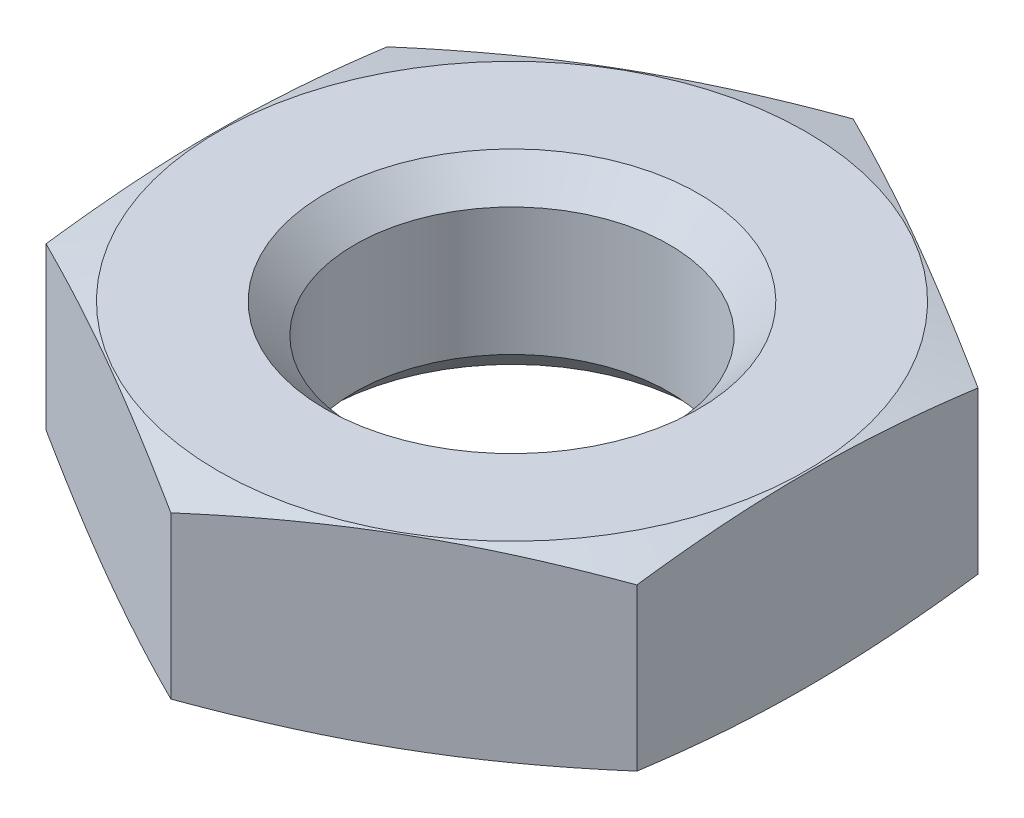
ISO-10303-21;
HEADER;
FILE_DESCRIPTION(('STEP AP214'),'2;1');
FILE_NAME('part.step','',(''),(''),'','','');
FILE_SCHEMA(('AUTOMOTIVE_DESIGN { 1 0 10303 214 1 1 1 1 }'));
ENDSEC;
DATA;
#1=APPLICATION_CONTEXT('core data for automotive mechanical design processes');
#2=APPLICATION_PROTOCOL_DEFINITION('international standard','automotive_design',2000,#1);
#3=PRODUCT_CONTEXT('',#1,'mechanical');
#4=PRODUCT('Part','Part','',(#3));
#5=PRODUCT_RELATED_PRODUCT_CATEGORY('part','',(#4));
#6=PRODUCT_DEFINITION_FORMATION('','',#4);
#7=PRODUCT_DEFINITION_CONTEXT('part definition',#1,'design');
#8=PRODUCT_DEFINITION('design','',#6,#7);
#9=PRODUCT_DEFINITION_SHAPE('','',#8);
#10=(LENGTH_UNIT() NAMED_UNIT(*) SI_UNIT(.MILLI.,.METRE.));
#11=(NAMED_UNIT(*) PLANE_ANGLE_UNIT() SI_UNIT($,.RADIAN.));
#12=(NAMED_UNIT(*) SI_UNIT($,.STERADIAN.) SOLID_ANGLE_UNIT());
#13=UNCERTAINTY_MEASURE_WITH_UNIT(LENGTH_MEASURE(1.E-05),#10,'distance_accuracy_value','');
#14=(GEOMETRIC_REPRESENTATION_CONTEXT(3) GLOBAL_UNCERTAINTY_ASSIGNED_CONTEXT((#13)) GLOBAL_UNIT_ASSIGNED_CONTEXT((#10,
#11,#12)) REPRESENTATION_CONTEXT('',''));
#15=CARTESIAN_POINT('',(0.,0.,0.));
#16=DIRECTION('',(0.,0.,1.));
#17=DIRECTION('',(1.,0.,0.));
#18=AXIS2_PLACEMENT_3D('',#15,#16,#17);
#19=CARTESIAN_POINT('',(0.,0.,0.));
#20=DIRECTION('',(0.,1.,0.));
#21=DIRECTION('',(0.,0.,1.));
#22=AXIS2_PLACEMENT_3D('',#19,#20,#21);
#23=PLANE('',#22);
#24=CARTESIAN_POINT('',(0.,0.,0.));
#25=DIRECTION('',(0.,1.,0.));
#26=DIRECTION('',(0.,0.,1.));
#27=AXIS2_PLACEMENT_3D('',#24,#25,#26);
#28=CIRCLE('',#27,6.);
#29=CARTESIAN_POINT('',(0.,0.,6.));
#30=VERTEX_POINT('',#29);
#31=EDGE_CURVE('E104',#30,#30,#28,.T.);
#32=ORIENTED_EDGE('',*,*,#31,.F.);
#33=EDGE_LOOP('',(#32));
#34=FACE_BOUND('',#33,.T.);
#35=CARTESIAN_POINT('',(0.,0.,0.));
#36=DIRECTION('',(0.,-1.,0.));
#37=DIRECTION('',(0.,0.,-1.));
#38=AXIS2_PLACEMENT_3D('',#35,#36,#37);
#39=CIRCLE('',#38,9.45);
#40=CARTESIAN_POINT('',(0.,0.,-9.45));
#41=VERTEX_POINT('',#40);
#42=EDGE_CURVE('E95',#41,#41,#39,.T.);
#43=ORIENTED_EDGE('',*,*,#42,.F.);
#44=EDGE_LOOP('',(#43));
#45=FACE_BOUND('',#44,.T.);
#46=ADVANCED_FACE('F35',(#34,#45),#23,.T.);
#47=CARTESIAN_POINT('',(0.,-3.,0.));
#48=DIRECTION('',(0.,-1.,0.));
#49=DIRECTION('',(0.,0.,-1.));
#50=AXIS2_PLACEMENT_3D('',#47,#48,#49);
#51=CONICAL_SURFACE('',#50,20.6461524227066,1.30899693899575);
#52=CARTESIAN_POINT('',(-9.5,-2.65271852718034,16.8575089634561));
#53=CARTESIAN_POINT('',(-9.5,-2.55792623123244,16.4513749844724));
#54=CARTESIAN_POINT('',(-9.5,-2.46389301942564,16.0450620927087));
#55=CARTESIAN_POINT('',(-9.5,-2.27769044820152,15.2320030409939));
#56=CARTESIAN_POINT('',(-9.5,-2.18552111797698,14.8252568743616));
#57=CARTESIAN_POINT('',(-9.5,-2.00337856324963,14.011195153163));
#58=CARTESIAN_POINT('',(-9.5,-1.91340573772246,13.6038795091545));
#59=CARTESIAN_POINT('',(-9.5,-1.73612888302161,12.7886681296335));
#60=CARTESIAN_POINT('',(-9.5,-1.64882484544963,12.3807723959506));
#61=CARTESIAN_POINT('',(-9.5,-1.47661188192415,11.5603167165323));
#62=CARTESIAN_POINT('',(-9.5,-1.39173464650062,11.1477501015404));
#63=CARTESIAN_POINT('',(-9.5,-1.226003346001,10.3218101778919));
#64=CARTESIAN_POINT('',(-9.5,-1.14514925000314,9.90843687546084));
#65=CARTESIAN_POINT('',(-9.5,-0.988363980886279,9.08070337328055));
#66=CARTESIAN_POINT('',(-9.5,-0.912433387299522,8.66634306328299));
#67=CARTESIAN_POINT('',(-9.5,-0.766631928515803,7.83655147272426));
#68=CARTESIAN_POINT('',(-9.5,-0.69676106124069,7.42112019253044));
#69=CARTESIAN_POINT('',(-9.5,-0.566265541075165,6.60050394643802));
#70=CARTESIAN_POINT('',(-9.5,-0.505439523436686,6.1953512222448));
#71=CARTESIAN_POINT('',(-9.5,-0.39228301032821,5.38385004063205));
#72=CARTESIAN_POINT('',(-9.5,-0.339952516856323,4.9775015829313));
#73=CARTESIAN_POINT('',(-9.5,-0.245419165397451,4.16371888040964));
#74=CARTESIAN_POINT('',(-9.5,-0.203213749395698,3.75628493618426));
#75=CARTESIAN_POINT('',(-9.5,-0.130544120125363,2.94037488916046));
#76=CARTESIAN_POINT('',(-9.5,-0.100079378936265,2.53189883405222));
#77=CARTESIAN_POINT('',(-9.5,-0.0524031323027358,1.71601682902896));
#78=CARTESIAN_POINT('',(-9.5,-0.035132262716839,1.30861440413886));
#79=CARTESIAN_POINT('',(-9.5,-0.0145101125098399,0.493453724110203));
#80=CARTESIAN_POINT('',(-9.5,-0.0111587498498252,0.0856954710829949));
#81=CARTESIAN_POINT('',(-9.5,-0.018559962532105,-0.729718268059321));
#82=CARTESIAN_POINT('',(-9.5,-0.0293134585793734,-1.13737374572831));
#83=CARTESIAN_POINT('',(-9.5,-0.0643454346973465,-1.95208907501846));
#84=CARTESIAN_POINT('',(-9.5,-0.088623903890678,-2.35914892711838));
#85=CARTESIAN_POINT('',(-9.5,-0.163169088783214,-3.35436929821286));
#86=CARTESIAN_POINT('',(-9.5,-0.220204398181307,-3.94202297519024));
#87=CARTESIAN_POINT('',(-9.5,-0.35540022714916,-5.11480436803914));
#88=CARTESIAN_POINT('',(-9.5,-0.433560244595733,-5.6999321436142));
#89=CARTESIAN_POINT('',(-9.5,-0.606478767697048,-6.86970440911358));
#90=CARTESIAN_POINT('',(-9.5,-0.70129224071264,-7.45434064766869));
#91=CARTESIAN_POINT('',(-9.5,-0.903285218101364,-8.62143903828714));
#92=CARTESIAN_POINT('',(-9.5,-1.01046457844592,-9.20390121559075));
#93=CARTESIAN_POINT('',(-9.5,-1.23644887252652,-10.3793511614531));
#94=CARTESIAN_POINT('',(-9.5,-1.35545197557694,-10.9723005349542));
#95=CARTESIAN_POINT('',(-9.5,-1.60068059450294,-12.1567025022624));
#96=CARTESIAN_POINT('',(-9.5,-1.72690619982741,-12.7481550774373));
#97=CARTESIAN_POINT('',(-9.5,-1.98408134743562,-13.9264755039424));
#98=CARTESIAN_POINT('',(-9.5,-2.11499965094616,-14.5133501972922));
#99=CARTESIAN_POINT('',(-9.5,-2.31448861458854,-15.3929321974678));
#100=CARTESIAN_POINT('',(-9.5,-2.38150117262075,-15.6859945016653));
#101=CARTESIAN_POINT('',(-9.5,-2.51644781251085,-16.2719055046497));
#102=CARTESIAN_POINT('',(-9.5,-2.58438189011124,-16.5647542044168));
#103=CARTESIAN_POINT('',(-9.5,-2.65271852718034,-16.8575089634561));
#104=B_SPLINE_CURVE_WITH_KNOTS('',3,(#52,#53,#54,#55,#56,#57,#58,#59,#60,#61,#62,#63,#64,#65,
#66,#67,#68,#69,#70,#71,#72,#73,#74,#75,#76,#77,#78,#79,#80,#81,#82,#83,#84,#85,#86,#87,#88,#89,
#90,#91,#92,#93,#94,#95,#96,#97,#98,#99,#100,#101,#102,#103),.UNSPECIFIED.,.F.,.F.,(4,2,2,2,2,2,
2,2,2,2,2,2,2,2,2,2,2,2,2,2,2,2,2,2,2,4),(0.,1.25115067282753,2.50232092645623,3.75371677816341,
5.0051086914982,6.26871353890683,7.53230867277292,8.79605227203693,10.0597954379051,
11.2888011716531,12.5178071944576,13.7465023915734,14.9751423338493,16.1982210676657,
17.4212925928796,18.6444439589556,19.8675943413214,21.6383254775599,23.4090145281527,
25.1856617790066,26.9622883388948,28.7765487431308,30.5908316213985,32.3947109378124,
33.2965888338627,34.1984625645822),.UNSPECIFIED.);
#105=CARTESIAN_POINT('',(-9.5,-0.40719036073167,5.48482755730144));
#106=VERTEX_POINT('',#105);
#107=CARTESIAN_POINT('',(-9.5,-0.40719036073167,-5.48482755730144));
#108=VERTEX_POINT('',#107);
#109=EDGE_CURVE('E102',#106,#108,#104,.T.);
#110=ORIENTED_EDGE('',*,*,#109,.F.);
#111=CARTESIAN_POINT('',(0.000200000000000405,-0.407221301327873,10.9697705846567));
#112=CARTESIAN_POINT('',(-0.394327722084067,-0.346162628123151,10.7419898981087));
#113=CARTESIAN_POINT('',(-0.789570756660776,-0.290731476819723,10.5137962257005));
#114=CARTESIAN_POINT('',(-1.581452623938,-0.193344199932046,10.0566030164617));
#115=CARTESIAN_POINT('',(-1.97809195762644,-0.151393547355196,9.82760319038544));
#116=CARTESIAN_POINT('',(-2.77036165664143,-0.0834162658033219,9.37018606638835));
#117=CARTESIAN_POINT('',(-3.16598666491861,-0.0573085729421412,9.14177186136137));
#118=CARTESIAN_POINT('',(-3.95774119043103,-0.022300834401008,8.68465217292467));
#119=CARTESIAN_POINT('',(-4.35387059521551,-0.0133974596215577,8.45594675443842));
#120=CARTESIAN_POINT('',(-5.14612940478448,-0.0133974596215572,7.99853591746592));
#121=CARTESIAN_POINT('',(-5.54225880956897,-0.0223008344010071,7.76983049897967));
#122=CARTESIAN_POINT('',(-6.33401333508139,-0.0573085729421393,7.31271081054297));
#123=CARTESIAN_POINT('',(-6.72963834335856,-0.0834162658033195,7.08429660551599));
#124=CARTESIAN_POINT('',(-7.52190804237355,-0.151393547355194,6.62687948151891));
#125=CARTESIAN_POINT('',(-7.918547376062,-0.193344199932043,6.39787965544269));
#126=CARTESIAN_POINT('',(-8.71042924333922,-0.29073147681972,5.9406864462038));
#127=CARTESIAN_POINT('',(-9.10567227791593,-0.346162628123147,5.71249277379561));
#128=CARTESIAN_POINT('',(-9.5002,-0.407221301327869,5.4847120872476));
#129=B_SPLINE_CURVE_WITH_KNOTS('',3,(#111,#112,#113,#114,#115,#116,#117,#118,#119,#120,#121,
#122,#123,#124,#125,#126,#127,#128),.UNSPECIFIED.,.F.,.F.,(4,2,2,2,2,2,2,2,4),(0.,
1.37897722075449,2.75851359330414,4.13093041065496,5.50308163364594,6.87523285663691,
8.24764967398774,9.62718604653739,11.0061632672919),.UNSPECIFIED.);
#130=CARTESIAN_POINT('',(0.,-0.407190360731673,10.9696551146029));
#131=VERTEX_POINT('',#130);
#132=EDGE_CURVE('E139',#131,#106,#129,.T.);
#133=ORIENTED_EDGE('',*,*,#132,.F.);
#134=CARTESIAN_POINT('',(9.5002,-0.407221301327869,5.4847120872476));
#135=CARTESIAN_POINT('',(9.10567227791593,-0.346162628123147,5.71249277379561));
#136=CARTESIAN_POINT('',(8.71042924333922,-0.29073147681972,5.9406864462038));
#137=CARTESIAN_POINT('',(7.918547376062,-0.193344199932044,6.39787965544269));
#138=CARTESIAN_POINT('',(7.52190804237356,-0.151393547355194,6.62687948151891));
#139=CARTESIAN_POINT('',(6.72963834335857,-0.0834162658033202,7.084296605516));
#140=CARTESIAN_POINT('',(6.33401333508139,-0.0573085729421398,7.31271081054297));
#141=CARTESIAN_POINT('',(5.54225880956897,-0.0223008344010072,7.76983049897967));
#142=CARTESIAN_POINT('',(5.14612940478448,-0.0133974596215572,7.99853591746592));
#143=CARTESIAN_POINT('',(4.35387059521552,-0.0133974596215575,8.45594675443842));
#144=CARTESIAN_POINT('',(3.95774119043103,-0.0223008344010079,8.68465217292467));
#145=CARTESIAN_POINT('',(3.16598666491861,-0.0573085729421411,9.14177186136137));
#146=CARTESIAN_POINT('',(2.77036165664143,-0.0834162658033218,9.37018606638835));
#147=CARTESIAN_POINT('',(1.97809195762644,-0.151393547355196,9.82760319038544));
#148=CARTESIAN_POINT('',(1.581452623938,-0.193344199932046,10.0566030164617));
#149=CARTESIAN_POINT('',(0.789570756660776,-0.290731476819723,10.5137962257005));
#150=CARTESIAN_POINT('',(0.394327722084067,-0.346162628123151,10.7419898981087));
#151=CARTESIAN_POINT('',(-0.000199999999999532,-0.407221301327873,10.9697705846567));
#152=B_SPLINE_CURVE_WITH_KNOTS('',3,(#134,#135,#136,#137,#138,#139,#140,#141,#142,#143,#144,
#145,#146,#147,#148,#149,#150,#151),.UNSPECIFIED.,.F.,.F.,(4,2,2,2,2,2,2,2,4),(0.,
1.37897722075449,2.75851359330414,4.13093041065496,5.50308163364594,6.87523285663692,
8.24764967398774,9.62718604653739,11.0061632672919),.UNSPECIFIED.);
#153=CARTESIAN_POINT('',(9.5,-0.40719036073167,5.48482755730144));
#154=VERTEX_POINT('',#153);
#155=EDGE_CURVE('E146',#154,#131,#152,.T.);
#156=ORIENTED_EDGE('',*,*,#155,.F.);
#157=CARTESIAN_POINT('',(9.5,-2.65271852718034,-16.8575089634561));
#158=CARTESIAN_POINT('',(9.5,-2.55792623123244,-16.4513749844724));
#159=CARTESIAN_POINT('',(9.5,-2.46389301942564,-16.0450620927087));
#160=CARTESIAN_POINT('',(9.5,-2.27769044820152,-15.2320030409939));
#161=CARTESIAN_POINT('',(9.5,-2.18552111797698,-14.8252568743616));
#162=CARTESIAN_POINT('',(9.5,-2.00337856324963,-14.011195153163));
#163=CARTESIAN_POINT('',(9.5,-1.91340573772246,-13.6038795091545));
#164=CARTESIAN_POINT('',(9.5,-1.73612888302161,-12.7886681296335));
#165=CARTESIAN_POINT('',(9.5,-1.64882484544963,-12.3807723959506));
#166=CARTESIAN_POINT('',(9.5,-1.47661188192415,-11.5603167165323));
#167=CARTESIAN_POINT('',(9.5,-1.39173464650062,-11.1477501015404));
#168=CARTESIAN_POINT('',(9.5,-1.226003346001,-10.3218101778919));
#169=CARTESIAN_POINT('',(9.5,-1.14514925000314,-9.90843687546084));
#170=CARTESIAN_POINT('',(9.5,-0.988363980886279,-9.08070337328055));
#171=CARTESIAN_POINT('',(9.5,-0.912433387299522,-8.66634306328299));
#172=CARTESIAN_POINT('',(9.5,-0.766631928515803,-7.83655147272426));
#173=CARTESIAN_POINT('',(9.5,-0.69676106124069,-7.42112019253044));
#174=CARTESIAN_POINT('',(9.5,-0.566265541075165,-6.60050394643802));
#175=CARTESIAN_POINT('',(9.5,-0.505439523436686,-6.1953512222448));
#176=CARTESIAN_POINT('',(9.5,-0.39228301032821,-5.38385004063205));
#177=CARTESIAN_POINT('',(9.5,-0.339952516856323,-4.9775015829313));
#178=CARTESIAN_POINT('',(9.5,-0.245419165397451,-4.16371888040964));
#179=CARTESIAN_POINT('',(9.5,-0.203213749395698,-3.75628493618426));
#180=CARTESIAN_POINT('',(9.5,-0.130544120125363,-2.94037488916046));
#181=CARTESIAN_POINT('',(9.5,-0.100079378936265,-2.53189883405222));
#182=CARTESIAN_POINT('',(9.5,-0.0524031323027358,-1.71601682902896));
#183=CARTESIAN_POINT('',(9.5,-0.035132262716839,-1.30861440413886));
#184=CARTESIAN_POINT('',(9.5,-0.0145101125098399,-0.493453724110203));
#185=CARTESIAN_POINT('',(9.5,-0.0111587498498252,-0.0856954710829949));
#186=CARTESIAN_POINT('',(9.5,-0.018559962532105,0.729718268059321));
#187=CARTESIAN_POINT('',(9.5,-0.0293134585793734,1.13737374572831));
#188=CARTESIAN_POINT('',(9.5,-0.0643454346973465,1.95208907501846));
#189=CARTESIAN_POINT('',(9.5,-0.088623903890678,2.35914892711838));
#190=CARTESIAN_POINT('',(9.5,-0.163169088783214,3.35436929821286));
#191=CARTESIAN_POINT('',(9.5,-0.220204398181307,3.94202297519024));
#192=CARTESIAN_POINT('',(9.5,-0.35540022714916,5.11480436803914));
#193=CARTESIAN_POINT('',(9.5,-0.433560244595733,5.6999321436142));
#194=CARTESIAN_POINT('',(9.5,-0.606478767697048,6.86970440911358));
#195=CARTESIAN_POINT('',(9.5,-0.70129224071264,7.45434064766869));
#196=CARTESIAN_POINT('',(9.5,-0.903285218101364,8.62143903828714));
#197=CARTESIAN_POINT('',(9.5,-1.01046457844592,9.20390121559075));
#198=CARTESIAN_POINT('',(9.5,-1.23644887252652,10.3793511614531));
#199=CARTESIAN_POINT('',(9.5,-1.35545197557694,10.9723005349542));
#200=CARTESIAN_POINT('',(9.5,-1.60068059450294,12.1567025022624));
#201=CARTESIAN_POINT('',(9.5,-1.72690619982741,12.7481550774373));
#202=CARTESIAN_POINT('',(9.5,-1.98408134743562,13.9264755039424));
#203=CARTESIAN_POINT('',(9.5,-2.11499965094616,14.5133501972922));
#204=CARTESIAN_POINT('',(9.5,-2.31448861458854,15.3929321974678));
#205=CARTESIAN_POINT('',(9.5,-2.38150117262075,15.6859945016653));
#206=CARTESIAN_POINT('',(9.5,-2.51644781251085,16.2719055046497));
#207=CARTESIAN_POINT('',(9.5,-2.58438189011124,16.5647542044168));
#208=CARTESIAN_POINT('',(9.5,-2.65271852718034,16.8575089634561));
#209=B_SPLINE_CURVE_WITH_KNOTS('',3,(#157,#158,#159,#160,#161,#162,#163,#164,#165,#166,#167,
#168,#169,#170,#171,#172,#173,#174,#175,#176,#177,#178,#179,#180,#181,#182,#183,#184,#185,#186,
#187,#188,#189,#190,#191,#192,#193,#194,#195,#196,#197,#198,#199,#200,#201,#202,#203,#204,#205,
#206,#207,#208),.UNSPECIFIED.,.F.,.F.,(4,2,2,2,2,2,2,2,2,2,2,2,2,2,2,2,2,2,2,2,2,2,2,2,2,4),(0.,
1.25115067282753,2.50232092645623,3.75371677816341,5.0051086914982,6.26871353890683,
7.53230867277292,8.79605227203693,10.0597954379051,11.2888011716531,12.5178071944576,
13.7465023915734,14.9751423338493,16.1982210676657,17.4212925928796,18.6444439589556,
19.8675943413214,21.6383254775599,23.4090145281527,25.1856617790066,26.9622883388948,
28.7765487431308,30.5908316213985,32.3947109378124,33.2965888338627,34.1984625645822),.UNSPECIFIED.);
#210=CARTESIAN_POINT('',(9.5,-0.40719036073167,-5.48482755730144));
#211=VERTEX_POINT('',#210);
#212=EDGE_CURVE('E181',#211,#154,#209,.T.);
#213=ORIENTED_EDGE('',*,*,#212,.F.);
#214=CARTESIAN_POINT('',(-0.000200000000000405,-0.407221301327873,-10.9697705846567));
#215=CARTESIAN_POINT('',(0.394327722084067,-0.346162628123151,-10.7419898981087));
#216=CARTESIAN_POINT('',(0.789570756660776,-0.290731476819723,-10.5137962257005));
#217=CARTESIAN_POINT('',(1.581452623938,-0.193344199932046,-10.0566030164617));
#218=CARTESIAN_POINT('',(1.97809195762644,-0.151393547355196,-9.82760319038544));
#219=CARTESIAN_POINT('',(2.77036165664143,-0.0834162658033219,-9.37018606638835));
#220=CARTESIAN_POINT('',(3.16598666491861,-0.0573085729421412,-9.14177186136137));
#221=CARTESIAN_POINT('',(3.95774119043103,-0.022300834401008,-8.68465217292467));
#222=CARTESIAN_POINT('',(4.35387059521551,-0.0133974596215577,-8.45594675443842));
#223=CARTESIAN_POINT('',(5.14612940478448,-0.0133974596215572,-7.99853591746592));
#224=CARTESIAN_POINT('',(5.54225880956897,-0.0223008344010071,-7.76983049897967));
#225=CARTESIAN_POINT('',(6.33401333508139,-0.0573085729421393,-7.31271081054297));
#226=CARTESIAN_POINT('',(6.72963834335856,-0.0834162658033195,-7.08429660551599));
#227=CARTESIAN_POINT('',(7.52190804237355,-0.151393547355194,-6.62687948151891));
#228=CARTESIAN_POINT('',(7.918547376062,-0.193344199932043,-6.39787965544269));
#229=CARTESIAN_POINT('',(8.71042924333922,-0.29073147681972,-5.9406864462038));
#230=CARTESIAN_POINT('',(9.10567227791593,-0.346162628123147,-5.71249277379561));
#231=CARTESIAN_POINT('',(9.5002,-0.407221301327869,-5.4847120872476));
#232=B_SPLINE_CURVE_WITH_KNOTS('',3,(#214,#215,#216,#217,#218,#219,#220,#221,#222,#223,#224,
#225,#226,#227,#228,#229,#230,#231),.UNSPECIFIED.,.F.,.F.,(4,2,2,2,2,2,2,2,4),(0.,
1.37897722075449,2.75851359330414,4.13093041065496,5.50308163364594,6.87523285663691,
8.24764967398774,9.62718604653739,11.0061632672919),.UNSPECIFIED.);
#233=CARTESIAN_POINT('',(0.,-0.407190360731673,-10.9696551146029));
#234=VERTEX_POINT('',#233);
#235=EDGE_CURVE('E174',#234,#211,#232,.T.);
#236=ORIENTED_EDGE('',*,*,#235,.F.);
#237=CARTESIAN_POINT('',(-9.5002,-0.407221301327869,-5.4847120872476));
#238=CARTESIAN_POINT('',(-9.10567227791593,-0.346162628123147,-5.71249277379561));
#239=CARTESIAN_POINT('',(-8.71042924333922,-0.29073147681972,-5.9406864462038));
#240=CARTESIAN_POINT('',(-7.918547376062,-0.193344199932044,-6.39787965544269));
#241=CARTESIAN_POINT('',(-7.52190804237356,-0.151393547355194,-6.62687948151891));
#242=CARTESIAN_POINT('',(-6.72963834335857,-0.0834162658033202,-7.084296605516));
#243=CARTESIAN_POINT('',(-6.33401333508139,-0.0573085729421398,-7.31271081054297));
#244=CARTESIAN_POINT('',(-5.54225880956897,-0.0223008344010072,-7.76983049897967));
#245=CARTESIAN_POINT('',(-5.14612940478448,-0.0133974596215572,-7.99853591746592));
#246=CARTESIAN_POINT('',(-4.35387059521552,-0.0133974596215575,-8.45594675443842));
#247=CARTESIAN_POINT('',(-3.95774119043103,-0.0223008344010079,-8.68465217292467));
#248=CARTESIAN_POINT('',(-3.16598666491861,-0.0573085729421411,-9.14177186136137));
#249=CARTESIAN_POINT('',(-2.77036165664143,-0.0834162658033218,-9.37018606638835));
#250=CARTESIAN_POINT('',(-1.97809195762644,-0.151393547355196,-9.82760319038544));
#251=CARTESIAN_POINT('',(-1.581452623938,-0.193344199932046,-10.0566030164617));
#252=CARTESIAN_POINT('',(-0.789570756660776,-0.290731476819723,-10.5137962257005));
#253=CARTESIAN_POINT('',(-0.394327722084067,-0.346162628123151,-10.7419898981087));
#254=CARTESIAN_POINT('',(0.000199999999999532,-0.407221301327873,-10.9697705846567));
#255=B_SPLINE_CURVE_WITH_KNOTS('',3,(#237,#238,#239,#240,#241,#242,#243,#244,#245,#246,#247,
#248,#249,#250,#251,#252,#253,#254),.UNSPECIFIED.,.F.,.F.,(4,2,2,2,2,2,2,2,4),(0.,
1.37897722075449,2.75851359330414,4.13093041065496,5.50308163364594,6.87523285663692,
8.24764967398774,9.62718604653739,11.0061632672919),.UNSPECIFIED.);
#256=EDGE_CURVE('E164',#108,#234,#255,.T.);
#257=ORIENTED_EDGE('',*,*,#256,.F.);
#258=EDGE_LOOP('',(#110,#133,#156,#213,#236,#257));
#259=FACE_BOUND('',#258,.T.);
#260=ORIENTED_EDGE('',*,*,#42,.T.);
#261=EDGE_LOOP('',(#260));
#262=FACE_BOUND('',#261,.T.);
#263=ADVANCED_FACE('F157',(#259,#262),#51,.T.);
#264=CARTESIAN_POINT('',(-9.5,7.,-5.48482755730144));
#265=DIRECTION('',(1.,0.,0.));
#266=DIRECTION('',(0.,0.,-1.));
#267=AXIS2_PLACEMENT_3D('',#264,#265,#266);
#268=PLANE('',#267);
#269=ORIENTED_EDGE('',*,*,#109,.T.);
#270=DIRECTION('',(0.,-1.,0.));
#271=VECTOR('',#270,1.);
#272=CARTESIAN_POINT('',(-9.5,7.,-5.48482755730144));
#273=LINE('',#272,#271);
#274=CARTESIAN_POINT('',(-9.5,-5.59280963926833,-5.48482755730144));
#275=VERTEX_POINT('',#274);
#276=EDGE_CURVE('E55',#108,#275,#273,.T.);
#277=ORIENTED_EDGE('',*,*,#276,.T.);
#278=CARTESIAN_POINT('',(-9.5,-3.34728147281966,-16.8575089634561));
#279=CARTESIAN_POINT('',(-9.5,-3.44207376876756,-16.4513749844724));
#280=CARTESIAN_POINT('',(-9.5,-3.53610698057437,-16.0450620927087));
#281=CARTESIAN_POINT('',(-9.5,-3.72230955179848,-15.2320030409939));
#282=CARTESIAN_POINT('',(-9.5,-3.81447888202302,-14.8252568743616));
#283=CARTESIAN_POINT('',(-9.5,-3.99662143675037,-14.011195153163));
#284=CARTESIAN_POINT('',(-9.5,-4.08659426227754,-13.6038795091545));
#285=CARTESIAN_POINT('',(-9.5,-4.26387111697839,-12.7886681296335));
#286=CARTESIAN_POINT('',(-9.5,-4.35117515455037,-12.3807723959506));
#287=CARTESIAN_POINT('',(-9.5,-4.52338811807585,-11.5603167165323));
#288=CARTESIAN_POINT('',(-9.5,-4.60826535349938,-11.1477501015404));
#289=CARTESIAN_POINT('',(-9.5,-4.773996653999,-10.3218101778919));
#290=CARTESIAN_POINT('',(-9.5,-4.85485074999686,-9.90843687546083));
#291=CARTESIAN_POINT('',(-9.5,-5.01163601911372,-9.08070337328054));
#292=CARTESIAN_POINT('',(-9.5,-5.08756661270048,-8.66634306328299));
#293=CARTESIAN_POINT('',(-9.5,-5.2333680714842,-7.83655147272426));
#294=CARTESIAN_POINT('',(-9.5,-5.30323893875931,-7.42112019253044));
#295=CARTESIAN_POINT('',(-9.5,-5.43373445892484,-6.60050394643802));
#296=CARTESIAN_POINT('',(-9.5,-5.49456047656331,-6.1953512222448));
#297=CARTESIAN_POINT('',(-9.5,-5.60771698967179,-5.38385004063204));
#298=CARTESIAN_POINT('',(-9.5,-5.66004748314368,-4.9775015829313));
#299=CARTESIAN_POINT('',(-9.5,-5.75458083460255,-4.16371888040964));
#300=CARTESIAN_POINT('',(-9.5,-5.7967862506043,-3.75628493618426));
#301=CARTESIAN_POINT('',(-9.5,-5.86945587987464,-2.94037488916046));
#302=CARTESIAN_POINT('',(-9.5,-5.89992062106374,-2.53189883405222));
#303=CARTESIAN_POINT('',(-9.5,-5.94759686769727,-1.71601682902896));
#304=CARTESIAN_POINT('',(-9.5,-5.96486773728316,-1.30861440413886));
#305=CARTESIAN_POINT('',(-9.5,-5.98548988749016,-0.493453724110203));
#306=CARTESIAN_POINT('',(-9.5,-5.98884125015018,-0.0856954710829946));
#307=CARTESIAN_POINT('',(-9.5,-5.9814400374679,0.729718268059321));
#308=CARTESIAN_POINT('',(-9.5,-5.97068654142063,1.13737374572831));
#309=CARTESIAN_POINT('',(-9.5,-5.93565456530265,1.95208907501846));
#310=CARTESIAN_POINT('',(-9.5,-5.91137609610932,2.35914892711838));
#311=CARTESIAN_POINT('',(-9.5,-5.83683091121679,3.35436929821286));
#312=CARTESIAN_POINT('',(-9.5,-5.77979560181869,3.94202297519024));
#313=CARTESIAN_POINT('',(-9.5,-5.64459977285084,5.11480436803914));
#314=CARTESIAN_POINT('',(-9.5,-5.56643975540427,5.6999321436142));
#315=CARTESIAN_POINT('',(-9.5,-5.39352123230295,6.86970440911358));
#316=CARTESIAN_POINT('',(-9.5,-5.29870775928736,7.45434064766869));
#317=CARTESIAN_POINT('',(-9.5,-5.09671478189864,8.62143903828714));
#318=CARTESIAN_POINT('',(-9.5,-4.98953542155408,9.20390121559075));
#319=CARTESIAN_POINT('',(-9.5,-4.76355112747349,10.3793511614531));
#320=CARTESIAN_POINT('',(-9.5,-4.64454802442306,10.9723005349542));
#321=CARTESIAN_POINT('',(-9.5,-4.39931940549706,12.1567025022624));
#322=CARTESIAN_POINT('',(-9.5,-4.27309380017259,12.7481550774373));
#323=CARTESIAN_POINT('',(-9.5,-4.01591865256439,13.9264755039424));
#324=CARTESIAN_POINT('',(-9.5,-3.88500034905384,14.5133501972922));
#325=CARTESIAN_POINT('',(-9.5,-3.68551138541146,15.3929321974678));
#326=CARTESIAN_POINT('',(-9.5,-3.61849882737925,15.6859945016653));
#327=CARTESIAN_POINT('',(-9.5,-3.48355218748915,16.2719055046497));
#328=CARTESIAN_POINT('',(-9.5,-3.41561810988876,16.5647542044168));
#329=CARTESIAN_POINT('',(-9.5,-3.34728147281966,16.8575089634561));
#330=B_SPLINE_CURVE_WITH_KNOTS('',3,(#278,#279,#280,#281,#282,#283,#284,#285,#286,#287,#288,
#289,#290,#291,#292,#293,#294,#295,#296,#297,#298,#299,#300,#301,#302,#303,#304,#305,#306,#307,
#308,#309,#310,#311,#312,#313,#314,#315,#316,#317,#318,#319,#320,#321,#322,#323,#324,#325,#326,
#327,#328,#329),.UNSPECIFIED.,.F.,.F.,(4,2,2,2,2,2,2,2,2,2,2,2,2,2,2,2,2,2,2,2,2,2,2,2,2,4),(0.,
1.25115067282753,2.50232092645623,3.75371677816341,5.0051086914982,6.26871353890683,
7.53230867277292,8.79605227203693,10.0597954379051,11.2888011716531,12.5178071944576,
13.7465023915734,14.9751423338493,16.1982210676657,17.4212925928796,18.6444439589556,
19.8675943413214,21.6383254775599,23.4090145281527,25.1856617790066,26.9622883388948,
28.7765487431308,30.5908316213985,32.3947109378124,33.2965888338627,34.1984625645822),.UNSPECIFIED.);
#331=CARTESIAN_POINT('',(-9.5,-5.59280963926833,5.48482755730144));
#332=VERTEX_POINT('',#331);
#333=EDGE_CURVE('E11',#275,#332,#330,.T.);
#334=ORIENTED_EDGE('',*,*,#333,.T.);
#335=DIRECTION('',(0.,-1.,0.));
#336=VECTOR('',#335,1.);
#337=CARTESIAN_POINT('',(-9.5,7.,5.48482755730144));
#338=LINE('',#337,#336);
#339=EDGE_CURVE('E267',#106,#332,#338,.T.);
#340=ORIENTED_EDGE('',*,*,#339,.F.);
#341=EDGE_LOOP('',(#269,#277,#334,#340));
#342=FACE_BOUND('',#341,.T.);
#343=ADVANCED_FACE('F98',(#342),#268,.F.);
#344=CARTESIAN_POINT('',(-9.5,7.,5.48482755730144));
#345=DIRECTION('',(0.500000000000001,0.,-0.866025403784438));
#346=DIRECTION('',(-0.866025403784438,0.,-0.500000000000001));
#347=AXIS2_PLACEMENT_3D('',#344,#345,#346);
#348=PLANE('',#347);
#349=ORIENTED_EDGE('',*,*,#132,.T.);
#350=ORIENTED_EDGE('',*,*,#339,.T.);
#351=CARTESIAN_POINT('',(-9.5002,-5.59277869867213,5.4847120872476));
#352=CARTESIAN_POINT('',(-9.10567227791593,-5.65383737187685,5.71249277379561));
#353=CARTESIAN_POINT('',(-8.71042924333922,-5.70926852318028,5.9406864462038));
#354=CARTESIAN_POINT('',(-7.918547376062,-5.80665580006796,6.39787965544269));
#355=CARTESIAN_POINT('',(-7.52190804237356,-5.84860645264481,6.6268794815189));
#356=CARTESIAN_POINT('',(-6.72963834335857,-5.91658373419668,7.08429660551599));
#357=CARTESIAN_POINT('',(-6.33401333508139,-5.94269142705786,7.31271081054297));
#358=CARTESIAN_POINT('',(-5.54225880956897,-5.97769916559899,7.76983049897967));
#359=CARTESIAN_POINT('',(-5.14612940478448,-5.98660254037844,7.99853591746592));
#360=CARTESIAN_POINT('',(-4.35387059521552,-5.98660254037844,8.45594675443842));
#361=CARTESIAN_POINT('',(-3.95774119043103,-5.97769916559899,8.68465217292467));
#362=CARTESIAN_POINT('',(-3.16598666491861,-5.94269142705786,9.14177186136137));
#363=CARTESIAN_POINT('',(-2.77036165664143,-5.91658373419668,9.37018606638834));
#364=CARTESIAN_POINT('',(-1.97809195762644,-5.8486064526448,9.82760319038543));
#365=CARTESIAN_POINT('',(-1.581452623938,-5.80665580006795,10.0566030164617));
#366=CARTESIAN_POINT('',(-0.789570756660778,-5.70926852318028,10.5137962257005));
#367=CARTESIAN_POINT('',(-0.394327722084069,-5.65383737187685,10.7419898981087));
#368=CARTESIAN_POINT('',(0.000199999999998609,-5.59277869867213,10.9697705846567));
#369=B_SPLINE_CURVE_WITH_KNOTS('',3,(#351,#352,#353,#354,#355,#356,#357,#358,#359,#360,#361,
#362,#363,#364,#365,#366,#367,#368),.UNSPECIFIED.,.F.,.F.,(4,2,2,2,2,2,2,2,4),(0.,
1.37897722075449,2.75851359330414,4.13093041065496,5.50308163364594,6.87523285663692,
8.24764967398774,9.62718604653739,11.0061632672919),.UNSPECIFIED.);
#370=CARTESIAN_POINT('',(0.,-5.59280963926833,10.9696551146029));
#371=VERTEX_POINT('',#370);
#372=EDGE_CURVE('E48',#332,#371,#369,.T.);
#373=ORIENTED_EDGE('',*,*,#372,.T.);
#374=DIRECTION('',(0.,-1.,0.));
#375=VECTOR('',#374,1.);
#376=CARTESIAN_POINT('',(0.,7.,10.9696551146029));
#377=LINE('',#376,#375);
#378=EDGE_CURVE('E266',#131,#371,#377,.T.);
#379=ORIENTED_EDGE('',*,*,#378,.F.);
#380=EDGE_LOOP('',(#349,#350,#373,#379));
#381=FACE_BOUND('',#380,.T.);
#382=ADVANCED_FACE('F130',(#381),#348,.F.);
#383=CARTESIAN_POINT('',(0.,7.,10.9696551146029));
#384=DIRECTION('',(-0.500000000000001,0.,-0.866025403784438));
#385=DIRECTION('',(-0.866025403784438,0.,0.500000000000001));
#386=AXIS2_PLACEMENT_3D('',#383,#384,#385);
#387=PLANE('',#386);
#388=ORIENTED_EDGE('',*,*,#155,.T.);
#389=ORIENTED_EDGE('',*,*,#378,.T.);
#390=CARTESIAN_POINT('',(-0.000200000000000083,-5.59277869867213,10.9697705846567));
#391=CARTESIAN_POINT('',(0.394327722084067,-5.65383737187685,10.7419898981087));
#392=CARTESIAN_POINT('',(0.789570756660776,-5.70926852318028,10.5137962257005));
#393=CARTESIAN_POINT('',(1.581452623938,-5.80665580006795,10.0566030164617));
#394=CARTESIAN_POINT('',(1.97809195762644,-5.8486064526448,9.82760319038544));
#395=CARTESIAN_POINT('',(2.77036165664143,-5.91658373419668,9.37018606638835));
#396=CARTESIAN_POINT('',(3.16598666491861,-5.94269142705786,9.14177186136137));
#397=CARTESIAN_POINT('',(3.95774119043103,-5.97769916559899,8.68465217292467));
#398=CARTESIAN_POINT('',(4.35387059521551,-5.98660254037844,8.45594675443842));
#399=CARTESIAN_POINT('',(5.14612940478448,-5.98660254037844,7.99853591746592));
#400=CARTESIAN_POINT('',(5.54225880956897,-5.97769916559899,7.76983049897967));
#401=CARTESIAN_POINT('',(6.33401333508139,-5.94269142705786,7.31271081054297));
#402=CARTESIAN_POINT('',(6.72963834335856,-5.91658373419668,7.084296605516));
#403=CARTESIAN_POINT('',(7.52190804237355,-5.84860645264481,6.62687948151891));
#404=CARTESIAN_POINT('',(7.918547376062,-5.80665580006796,6.39787965544269));
#405=CARTESIAN_POINT('',(8.71042924333922,-5.70926852318028,5.9406864462038));
#406=CARTESIAN_POINT('',(9.10567227791593,-5.65383737187685,5.71249277379561));
#407=CARTESIAN_POINT('',(9.5002,-5.59277869867213,5.4847120872476));
#408=B_SPLINE_CURVE_WITH_KNOTS('',3,(#390,#391,#392,#393,#394,#395,#396,#397,#398,#399,#400,
#401,#402,#403,#404,#405,#406,#407),.UNSPECIFIED.,.F.,.F.,(4,2,2,2,2,2,2,2,4),(0.,
1.37897722075449,2.75851359330414,4.13093041065496,5.50308163364594,6.87523285663691,
8.24764967398773,9.62718604653738,11.0061632672919),.UNSPECIFIED.);
#409=CARTESIAN_POINT('',(9.5,-5.59280963926833,5.48482755730144));
#410=VERTEX_POINT('',#409);
#411=EDGE_CURVE('E111',#371,#410,#408,.T.);
#412=ORIENTED_EDGE('',*,*,#411,.T.);
#413=DIRECTION('',(0.,-1.,0.));
#414=VECTOR('',#413,1.);
#415=CARTESIAN_POINT('',(9.5,7.,5.48482755730144));
#416=LINE('',#415,#414);
#417=EDGE_CURVE('E263',#154,#410,#416,.T.);
#418=ORIENTED_EDGE('',*,*,#417,.F.);
#419=EDGE_LOOP('',(#388,#389,#412,#418));
#420=FACE_BOUND('',#419,.T.);
#421=ADVANCED_FACE('F133',(#420),#387,.F.);
#422=CARTESIAN_POINT('',(9.5,7.,5.48482755730144));
#423=DIRECTION('',(-1.,0.,0.));
#424=DIRECTION('',(0.,0.,1.));
#425=AXIS2_PLACEMENT_3D('',#422,#423,#424);
#426=PLANE('',#425);
#427=ORIENTED_EDGE('',*,*,#212,.T.);
#428=ORIENTED_EDGE('',*,*,#417,.T.);
#429=CARTESIAN_POINT('',(9.5,-3.34728147281966,16.8575089634561));
#430=CARTESIAN_POINT('',(9.5,-3.44207376876756,16.4513749844724));
#431=CARTESIAN_POINT('',(9.5,-3.53610698057437,16.0450620927087));
#432=CARTESIAN_POINT('',(9.5,-3.72230955179848,15.2320030409939));
#433=CARTESIAN_POINT('',(9.5,-3.81447888202302,14.8252568743616));
#434=CARTESIAN_POINT('',(9.5,-3.99662143675037,14.011195153163));
#435=CARTESIAN_POINT('',(9.5,-4.08659426227754,13.6038795091545));
#436=CARTESIAN_POINT('',(9.5,-4.26387111697839,12.7886681296335));
#437=CARTESIAN_POINT('',(9.5,-4.35117515455037,12.3807723959506));
#438=CARTESIAN_POINT('',(9.5,-4.52338811807585,11.5603167165323));
#439=CARTESIAN_POINT('',(9.5,-4.60826535349938,11.1477501015404));
#440=CARTESIAN_POINT('',(9.5,-4.773996653999,10.3218101778919));
#441=CARTESIAN_POINT('',(9.5,-4.85485074999686,9.90843687546083));
#442=CARTESIAN_POINT('',(9.5,-5.01163601911372,9.08070337328054));
#443=CARTESIAN_POINT('',(9.5,-5.08756661270048,8.66634306328299));
#444=CARTESIAN_POINT('',(9.5,-5.2333680714842,7.83655147272426));
#445=CARTESIAN_POINT('',(9.5,-5.30323893875931,7.42112019253044));
#446=CARTESIAN_POINT('',(9.5,-5.43373445892484,6.60050394643802));
#447=CARTESIAN_POINT('',(9.5,-5.49456047656331,6.1953512222448));
#448=CARTESIAN_POINT('',(9.5,-5.60771698967179,5.38385004063204));
#449=CARTESIAN_POINT('',(9.5,-5.66004748314368,4.9775015829313));
#450=CARTESIAN_POINT('',(9.5,-5.75458083460255,4.16371888040964));
#451=CARTESIAN_POINT('',(9.5,-5.7967862506043,3.75628493618426));
#452=CARTESIAN_POINT('',(9.5,-5.86945587987464,2.94037488916046));
#453=CARTESIAN_POINT('',(9.5,-5.89992062106374,2.53189883405222));
#454=CARTESIAN_POINT('',(9.5,-5.94759686769727,1.71601682902896));
#455=CARTESIAN_POINT('',(9.5,-5.96486773728316,1.30861440413886));
#456=CARTESIAN_POINT('',(9.5,-5.98548988749016,0.493453724110203));
#457=CARTESIAN_POINT('',(9.5,-5.98884125015018,0.0856954710829946));
#458=CARTESIAN_POINT('',(9.5,-5.9814400374679,-0.729718268059321));
#459=CARTESIAN_POINT('',(9.5,-5.97068654142063,-1.13737374572831));
#460=CARTESIAN_POINT('',(9.5,-5.93565456530265,-1.95208907501846));
#461=CARTESIAN_POINT('',(9.5,-5.91137609610932,-2.35914892711838));
#462=CARTESIAN_POINT('',(9.5,-5.83683091121679,-3.35436929821286));
#463=CARTESIAN_POINT('',(9.5,-5.77979560181869,-3.94202297519024));
#464=CARTESIAN_POINT('',(9.5,-5.64459977285084,-5.11480436803914));
#465=CARTESIAN_POINT('',(9.5,-5.56643975540427,-5.6999321436142));
#466=CARTESIAN_POINT('',(9.5,-5.39352123230295,-6.86970440911358));
#467=CARTESIAN_POINT('',(9.5,-5.29870775928736,-7.45434064766869));
#468=CARTESIAN_POINT('',(9.5,-5.09671478189864,-8.62143903828714));
#469=CARTESIAN_POINT('',(9.5,-4.98953542155408,-9.20390121559075));
#470=CARTESIAN_POINT('',(9.5,-4.76355112747349,-10.3793511614531));
#471=CARTESIAN_POINT('',(9.5,-4.64454802442306,-10.9723005349542));
#472=CARTESIAN_POINT('',(9.5,-4.39931940549706,-12.1567025022624));
#473=CARTESIAN_POINT('',(9.5,-4.27309380017259,-12.7481550774373));
#474=CARTESIAN_POINT('',(9.5,-4.01591865256439,-13.9264755039424));
#475=CARTESIAN_POINT('',(9.5,-3.88500034905384,-14.5133501972922));
#476=CARTESIAN_POINT('',(9.5,-3.68551138541146,-15.3929321974678));
#477=CARTESIAN_POINT('',(9.5,-3.61849882737925,-15.6859945016653));
#478=CARTESIAN_POINT('',(9.5,-3.48355218748915,-16.2719055046497));
#479=CARTESIAN_POINT('',(9.5,-3.41561810988876,-16.5647542044168));
#480=CARTESIAN_POINT('',(9.5,-3.34728147281966,-16.8575089634561));
#481=B_SPLINE_CURVE_WITH_KNOTS('',3,(#429,#430,#431,#432,#433,#434,#435,#436,#437,#438,#439,
#440,#441,#442,#443,#444,#445,#446,#447,#448,#449,#450,#451,#452,#453,#454,#455,#456,#457,#458,
#459,#460,#461,#462,#463,#464,#465,#466,#467,#468,#469,#470,#471,#472,#473,#474,#475,#476,#477,
#478,#479,#480),.UNSPECIFIED.,.F.,.F.,(4,2,2,2,2,2,2,2,2,2,2,2,2,2,2,2,2,2,2,2,2,2,2,2,2,4),(0.,
1.25115067282753,2.50232092645623,3.75371677816341,5.0051086914982,6.26871353890683,
7.53230867277292,8.79605227203693,10.0597954379051,11.2888011716531,12.5178071944576,
13.7465023915734,14.9751423338493,16.1982210676657,17.4212925928796,18.6444439589556,
19.8675943413214,21.6383254775599,23.4090145281527,25.1856617790066,26.9622883388948,
28.7765487431308,30.5908316213985,32.3947109378124,33.2965888338627,34.1984625645822),.UNSPECIFIED.);
#482=CARTESIAN_POINT('',(9.5,-5.59280963926833,-5.48482755730144));
#483=VERTEX_POINT('',#482);
#484=EDGE_CURVE('E115',#410,#483,#481,.T.);
#485=ORIENTED_EDGE('',*,*,#484,.T.);
#486=DIRECTION('',(0.,-1.,0.));
#487=VECTOR('',#486,1.);
#488=CARTESIAN_POINT('',(9.5,7.,-5.48482755730144));
#489=LINE('',#488,#487);
#490=EDGE_CURVE('E260',#211,#483,#489,.T.);
#491=ORIENTED_EDGE('',*,*,#490,.F.);
#492=EDGE_LOOP('',(#427,#428,#485,#491));
#493=FACE_BOUND('',#492,.T.);
#494=ADVANCED_FACE('F186',(#493),#426,.F.);
#495=CARTESIAN_POINT('',(9.5,7.,-5.48482755730144));
#496=DIRECTION('',(-0.500000000000001,0.,0.866025403784438));
#497=DIRECTION('',(0.866025403784438,0.,0.500000000000001));
#498=AXIS2_PLACEMENT_3D('',#495,#496,#497);
#499=PLANE('',#498);
#500=ORIENTED_EDGE('',*,*,#235,.T.);
#501=ORIENTED_EDGE('',*,*,#490,.T.);
#502=CARTESIAN_POINT('',(9.5002,-5.59277869867213,-5.4847120872476));
#503=CARTESIAN_POINT('',(9.10567227791593,-5.65383737187685,-5.71249277379561));
#504=CARTESIAN_POINT('',(8.71042924333922,-5.70926852318028,-5.9406864462038));
#505=CARTESIAN_POINT('',(7.918547376062,-5.80665580006796,-6.39787965544269));
#506=CARTESIAN_POINT('',(7.52190804237356,-5.84860645264481,-6.6268794815189));
#507=CARTESIAN_POINT('',(6.72963834335857,-5.91658373419668,-7.08429660551599));
#508=CARTESIAN_POINT('',(6.33401333508139,-5.94269142705786,-7.31271081054297));
#509=CARTESIAN_POINT('',(5.54225880956897,-5.97769916559899,-7.76983049897967));
#510=CARTESIAN_POINT('',(5.14612940478448,-5.98660254037844,-7.99853591746592));
#511=CARTESIAN_POINT('',(4.35387059521552,-5.98660254037844,-8.45594675443842));
#512=CARTESIAN_POINT('',(3.95774119043103,-5.97769916559899,-8.68465217292467));
#513=CARTESIAN_POINT('',(3.16598666491861,-5.94269142705786,-9.14177186136137));
#514=CARTESIAN_POINT('',(2.77036165664143,-5.91658373419668,-9.37018606638834));
#515=CARTESIAN_POINT('',(1.97809195762644,-5.8486064526448,-9.82760319038543));
#516=CARTESIAN_POINT('',(1.581452623938,-5.80665580006795,-10.0566030164617));
#517=CARTESIAN_POINT('',(0.789570756660778,-5.70926852318028,-10.5137962257005));
#518=CARTESIAN_POINT('',(0.394327722084069,-5.65383737187685,-10.7419898981087));
#519=CARTESIAN_POINT('',(-0.000199999999998609,-5.59277869867213,-10.9697705846567));
#520=B_SPLINE_CURVE_WITH_KNOTS('',3,(#502,#503,#504,#505,#506,#507,#508,#509,#510,#511,#512,
#513,#514,#515,#516,#517,#518,#519),.UNSPECIFIED.,.F.,.F.,(4,2,2,2,2,2,2,2,4),(0.,
1.37897722075449,2.75851359330414,4.13093041065496,5.50308163364594,6.87523285663692,
8.24764967398774,9.62718604653739,11.0061632672919),.UNSPECIFIED.);
#521=CARTESIAN_POINT('',(0.,-5.59280963926833,-10.9696551146029));
#522=VERTEX_POINT('',#521);
#523=EDGE_CURVE('E94',#483,#522,#520,.T.);
#524=ORIENTED_EDGE('',*,*,#523,.T.);
#525=DIRECTION('',(0.,-1.,0.));
#526=VECTOR('',#525,1.);
#527=CARTESIAN_POINT('',(0.,7.,-10.9696551146029));
#528=LINE('',#527,#526);
#529=EDGE_CURVE('E60',#234,#522,#528,.T.);
#530=ORIENTED_EDGE('',*,*,#529,.F.);
#531=EDGE_LOOP('',(#500,#501,#524,#530));
#532=FACE_BOUND('',#531,.T.);
#533=ADVANCED_FACE('F189',(#532),#499,.F.);
#534=CARTESIAN_POINT('',(0.,7.,-10.9696551146029));
#535=DIRECTION('',(0.500000000000001,0.,0.866025403784438));
#536=DIRECTION('',(0.866025403784438,0.,-0.500000000000001));
#537=AXIS2_PLACEMENT_3D('',#534,#535,#536);
#538=PLANE('',#537);
#539=ORIENTED_EDGE('',*,*,#256,.T.);
#540=ORIENTED_EDGE('',*,*,#529,.T.);
#541=CARTESIAN_POINT('',(0.000200000000000083,-5.59277869867213,-10.9697705846567));
#542=CARTESIAN_POINT('',(-0.394327722084067,-5.65383737187685,-10.7419898981087));
#543=CARTESIAN_POINT('',(-0.789570756660776,-5.70926852318028,-10.5137962257005));
#544=CARTESIAN_POINT('',(-1.581452623938,-5.80665580006795,-10.0566030164617));
#545=CARTESIAN_POINT('',(-1.97809195762644,-5.8486064526448,-9.82760319038544));
#546=CARTESIAN_POINT('',(-2.77036165664143,-5.91658373419668,-9.37018606638835));
#547=CARTESIAN_POINT('',(-3.16598666491861,-5.94269142705786,-9.14177186136137));
#548=CARTESIAN_POINT('',(-3.95774119043103,-5.97769916559899,-8.68465217292467));
#549=CARTESIAN_POINT('',(-4.35387059521551,-5.98660254037844,-8.45594675443842));
#550=CARTESIAN_POINT('',(-5.14612940478448,-5.98660254037844,-7.99853591746592));
#551=CARTESIAN_POINT('',(-5.54225880956897,-5.97769916559899,-7.76983049897967));
#552=CARTESIAN_POINT('',(-6.33401333508139,-5.94269142705786,-7.31271081054297));
#553=CARTESIAN_POINT('',(-6.72963834335856,-5.91658373419668,-7.084296605516));
#554=CARTESIAN_POINT('',(-7.52190804237355,-5.84860645264481,-6.62687948151891));
#555=CARTESIAN_POINT('',(-7.918547376062,-5.80665580006796,-6.39787965544269));
#556=CARTESIAN_POINT('',(-8.71042924333922,-5.70926852318028,-5.9406864462038));
#557=CARTESIAN_POINT('',(-9.10567227791593,-5.65383737187685,-5.71249277379561));
#558=CARTESIAN_POINT('',(-9.5002,-5.59277869867213,-5.4847120872476));
#559=B_SPLINE_CURVE_WITH_KNOTS('',3,(#541,#542,#543,#544,#545,#546,#547,#548,#549,#550,#551,
#552,#553,#554,#555,#556,#557,#558),.UNSPECIFIED.,.F.,.F.,(4,2,2,2,2,2,2,2,4),(0.,
1.37897722075449,2.75851359330414,4.13093041065496,5.50308163364594,6.87523285663691,
8.24764967398773,9.62718604653738,11.0061632672919),.UNSPECIFIED.);
#560=EDGE_CURVE('E89',#522,#275,#559,.T.);
#561=ORIENTED_EDGE('',*,*,#560,.T.);
#562=ORIENTED_EDGE('',*,*,#276,.F.);
#563=EDGE_LOOP('',(#539,#540,#561,#562));
#564=FACE_BOUND('',#563,.T.);
#565=ADVANCED_FACE('F90',(#564),#538,.F.);
#566=CARTESIAN_POINT('',(9.45,-6.,0.));
#567=DIRECTION('',(0.,-1.,0.));
#568=DIRECTION('',(0.,0.,-1.));
#569=AXIS2_PLACEMENT_3D('',#566,#567,#568);
#570=PLANE('',#569);
#571=CARTESIAN_POINT('',(0.,-6.,0.));
#572=DIRECTION('',(0.,1.,0.));
#573=DIRECTION('',(0.,0.,1.));
#574=AXIS2_PLACEMENT_3D('',#571,#572,#573);
#575=CIRCLE('',#574,6.);
#576=CARTESIAN_POINT('',(0.,-6.,6.));
#577=VERTEX_POINT('',#576);
#578=EDGE_CURVE('E250',#577,#577,#575,.T.);
#579=ORIENTED_EDGE('',*,*,#578,.T.);
#580=EDGE_LOOP('',(#579));
#581=FACE_BOUND('',#580,.T.);
#582=CARTESIAN_POINT('',(0.,-6.,0.));
#583=DIRECTION('',(0.,-1.,0.));
#584=DIRECTION('',(0.,0.,-1.));
#585=AXIS2_PLACEMENT_3D('',#582,#583,#584);
#586=CIRCLE('',#585,9.45);
#587=CARTESIAN_POINT('',(0.,-6.,-9.45));
#588=VERTEX_POINT('',#587);
#589=EDGE_CURVE('E237',#588,#588,#586,.T.);
#590=ORIENTED_EDGE('',*,*,#589,.T.);
#591=EDGE_LOOP('',(#590));
#592=FACE_BOUND('',#591,.T.);
#593=ADVANCED_FACE('F210',(#581,#592),#570,.T.);
#594=CARTESIAN_POINT('',(0.,-6.,0.));
#595=DIRECTION('',(0.,1.,0.));
#596=DIRECTION('',(0.,0.,1.));
#597=AXIS2_PLACEMENT_3D('',#594,#595,#596);
#598=CONICAL_SURFACE('',#597,9.45,1.30899693899575);
#599=ORIENTED_EDGE('',*,*,#333,.F.);
#600=ORIENTED_EDGE('',*,*,#560,.F.);
#601=ORIENTED_EDGE('',*,*,#523,.F.);
#602=ORIENTED_EDGE('',*,*,#484,.F.);
#603=ORIENTED_EDGE('',*,*,#411,.F.);
#604=ORIENTED_EDGE('',*,*,#372,.F.);
#605=EDGE_LOOP('',(#599,#600,#601,#602,#603,#604));
#606=FACE_BOUND('',#605,.T.);
#607=ORIENTED_EDGE('',*,*,#589,.F.);
#608=EDGE_LOOP('',(#607));
#609=FACE_BOUND('',#608,.T.);
#610=ADVANCED_FACE('F107',(#606,#609),#598,.T.);
#611=CARTESIAN_POINT('',(0.,-0.947,0.));
#612=DIRECTION('',(0.,1.,0.));
#613=DIRECTION('',(0.,0.,1.));
#614=AXIS2_PLACEMENT_3D('',#611,#612,#613);
#615=CONICAL_SURFACE('',#614,5.053,0.785398163397448);
#616=ORIENTED_EDGE('',*,*,#31,.T.);
#617=EDGE_LOOP('',(#616));
#618=FACE_BOUND('',#617,.T.);
#619=CARTESIAN_POINT('',(0.,-0.947,0.));
#620=DIRECTION('',(0.,1.,0.));
#621=DIRECTION('',(0.,0.,1.));
#622=AXIS2_PLACEMENT_3D('',#619,#620,#621);
#623=CIRCLE('',#622,5.053);
#624=CARTESIAN_POINT('',(0.,-0.947,5.053));
#625=VERTEX_POINT('',#624);
#626=EDGE_CURVE('E253',#625,#625,#623,.T.);
#627=ORIENTED_EDGE('',*,*,#626,.F.);
#628=EDGE_LOOP('',(#627));
#629=FACE_BOUND('',#628,.T.);
#630=ADVANCED_FACE('F211',(#618,#629),#615,.F.);
#631=CARTESIAN_POINT('',(0.,-6.,0.));
#632=DIRECTION('',(0.,1.,0.));
#633=DIRECTION('',(0.,0.,1.));
#634=AXIS2_PLACEMENT_3D('',#631,#632,#633);
#635=CYLINDRICAL_SURFACE('',#634,5.053);
#636=ORIENTED_EDGE('',*,*,#626,.T.);
#637=EDGE_LOOP('',(#636));
#638=FACE_BOUND('',#637,.T.);
#639=CARTESIAN_POINT('',(0.,-5.053,0.));
#640=DIRECTION('',(0.,1.,0.));
#641=DIRECTION('',(0.,0.,1.));
#642=AXIS2_PLACEMENT_3D('',#639,#640,#641);
#643=CIRCLE('',#642,5.053);
#644=CARTESIAN_POINT('',(0.,-5.053,5.053));
#645=VERTEX_POINT('',#644);
#646=EDGE_CURVE('E251',#645,#645,#643,.T.);
#647=ORIENTED_EDGE('',*,*,#646,.F.);
#648=EDGE_LOOP('',(#647));
#649=FACE_BOUND('',#648,.T.);
#650=ADVANCED_FACE('F215',(#638,#649),#635,.F.);
#651=CARTESIAN_POINT('',(0.,-6.,0.));
#652=DIRECTION('',(0.,-1.,0.));
#653=DIRECTION('',(0.,0.,-1.));
#654=AXIS2_PLACEMENT_3D('',#651,#652,#653);
#655=CONICAL_SURFACE('',#654,6.,0.785398163397448);
#656=ORIENTED_EDGE('',*,*,#646,.T.);
#657=EDGE_LOOP('',(#656));
#658=FACE_BOUND('',#657,.T.);
#659=ORIENTED_EDGE('',*,*,#578,.F.);
#660=EDGE_LOOP('',(#659));
#661=FACE_BOUND('',#660,.T.);
#662=ADVANCED_FACE('F219',(#658,#661),#655,.F.);
#663=CLOSED_SHELL('',(#46,#263,#343,#382,#421,#494,#533,#565,#593,#610,#630,#650,#662));
#664=MANIFOLD_SOLID_BREP('B2',#663);
#665=ADVANCED_BREP_SHAPE_REPRESENTATION('',(#18,#664),#14);
#666=SHAPE_DEFINITION_REPRESENTATION(#9,#665);
ENDSEC;
END-ISO-10303-21;
